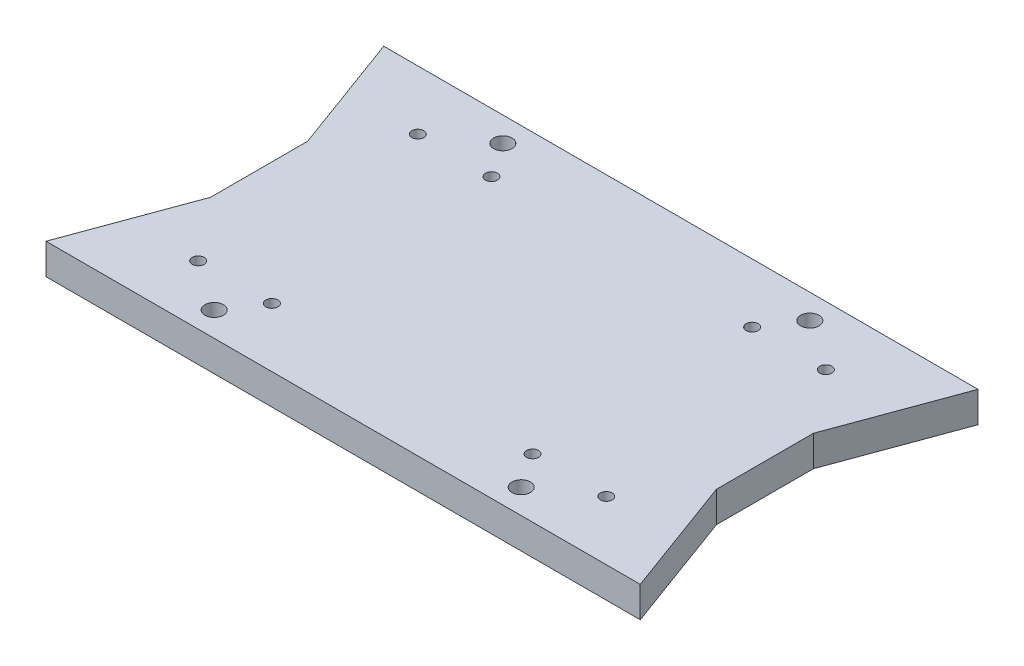
ISO-10303-21;
HEADER;
FILE_DESCRIPTION(('STEP AP214'),'2;1');
FILE_NAME('part.step','',(''),(''),'','','');
FILE_SCHEMA(('AUTOMOTIVE_DESIGN { 1 0 10303 214 1 1 1 1 }'));
ENDSEC;
DATA;
#1=APPLICATION_CONTEXT('core data for automotive mechanical design processes');
#2=APPLICATION_PROTOCOL_DEFINITION('international standard','automotive_design',2000,#1);
#3=PRODUCT_CONTEXT('',#1,'mechanical');
#4=PRODUCT('Part','Part','',(#3));
#5=PRODUCT_RELATED_PRODUCT_CATEGORY('part','',(#4));
#6=PRODUCT_DEFINITION_FORMATION('','',#4);
#7=PRODUCT_DEFINITION_CONTEXT('part definition',#1,'design');
#8=PRODUCT_DEFINITION('design','',#6,#7);
#9=PRODUCT_DEFINITION_SHAPE('','',#8);
#10=(LENGTH_UNIT() NAMED_UNIT(*) SI_UNIT(.MILLI.,.METRE.));
#11=(NAMED_UNIT(*) PLANE_ANGLE_UNIT() SI_UNIT($,.RADIAN.));
#12=(NAMED_UNIT(*) SI_UNIT($,.STERADIAN.) SOLID_ANGLE_UNIT());
#13=UNCERTAINTY_MEASURE_WITH_UNIT(LENGTH_MEASURE(1.E-05),#10,'distance_accuracy_value','');
#14=(GEOMETRIC_REPRESENTATION_CONTEXT(3) GLOBAL_UNCERTAINTY_ASSIGNED_CONTEXT((#13)) GLOBAL_UNIT_ASSIGNED_CONTEXT((#10,
#11,#12)) REPRESENTATION_CONTEXT('',''));
#15=CARTESIAN_POINT('',(0.,0.,0.));
#16=DIRECTION('',(0.,0.,1.));
#17=DIRECTION('',(1.,0.,0.));
#18=AXIS2_PLACEMENT_3D('',#15,#16,#17);
#19=CARTESIAN_POINT('',(0.,6.35,0.));
#20=DIRECTION('',(0.,1.,0.));
#21=DIRECTION('',(0.,0.,1.));
#22=AXIS2_PLACEMENT_3D('',#19,#20,#21);
#23=PLANE('',#22);
#24=CARTESIAN_POINT('',(103.635739134,6.35,-57.62800006));
#25=DIRECTION('',(0.,-1.,0.));
#26=DIRECTION('',(0.,0.,1.));
#27=AXIS2_PLACEMENT_3D('',#24,#25,#26);
#28=CIRCLE('',#27,1.2446);
#29=CARTESIAN_POINT('',(103.635739134,6.35,-56.38340006));
#30=VERTEX_POINT('',#29);
#31=EDGE_CURVE('E305',#30,#30,#28,.T.);
#32=ORIENTED_EDGE('',*,*,#31,.T.);
#33=EDGE_LOOP('',(#32));
#34=FACE_BOUND('',#33,.T.);
#35=CARTESIAN_POINT('',(88.395739134,6.35,-12.224999934));
#36=DIRECTION('',(0.,-1.,0.));
#37=DIRECTION('',(0.,0.,1.));
#38=AXIS2_PLACEMENT_3D('',#35,#36,#37);
#39=CIRCLE('',#38,1.2446);
#40=CARTESIAN_POINT('',(88.395739134,6.35,-10.980399934));
#41=VERTEX_POINT('',#40);
#42=EDGE_CURVE('E298',#41,#41,#39,.T.);
#43=ORIENTED_EDGE('',*,*,#42,.T.);
#44=EDGE_LOOP('',(#43));
#45=FACE_BOUND('',#44,.T.);
#46=CARTESIAN_POINT('',(103.635739134,6.35,-12.224999934));
#47=DIRECTION('',(0.,-1.,0.));
#48=DIRECTION('',(0.,0.,1.));
#49=AXIS2_PLACEMENT_3D('',#46,#47,#48);
#50=CIRCLE('',#49,1.2446);
#51=CARTESIAN_POINT('',(103.635739134,6.35,-10.980399934));
#52=VERTEX_POINT('',#51);
#53=EDGE_CURVE('E295',#52,#52,#50,.T.);
#54=ORIENTED_EDGE('',*,*,#53,.T.);
#55=EDGE_LOOP('',(#54));
#56=FACE_BOUND('',#55,.T.);
#57=CARTESIAN_POINT('',(88.395739134,6.35,-57.62800006));
#58=DIRECTION('',(0.,-1.,0.));
#59=DIRECTION('',(0.,0.,1.));
#60=AXIS2_PLACEMENT_3D('',#57,#58,#59);
#61=CIRCLE('',#60,1.2446);
#62=CARTESIAN_POINT('',(88.395739134,6.35,-56.38340006));
#63=VERTEX_POINT('',#62);
#64=EDGE_CURVE('E304',#63,#63,#61,.T.);
#65=ORIENTED_EDGE('',*,*,#64,.T.);
#66=EDGE_LOOP('',(#65));
#67=FACE_BOUND('',#66,.T.);
#68=CARTESIAN_POINT('',(19.250278238,6.35,-57.62800006));
#69=DIRECTION('',(0.,1.,0.));
#70=DIRECTION('',(0.,0.,1.));
#71=AXIS2_PLACEMENT_3D('',#68,#69,#70);
#72=CIRCLE('',#71,1.2446);
#73=CARTESIAN_POINT('',(19.250278238,6.35,-56.38340006));
#74=VERTEX_POINT('',#73);
#75=EDGE_CURVE('E157',#74,#74,#72,.T.);
#76=ORIENTED_EDGE('',*,*,#75,.F.);
#77=EDGE_LOOP('',(#76));
#78=FACE_BOUND('',#77,.T.);
#79=CARTESIAN_POINT('',(34.490278238,6.35,-12.224999934));
#80=DIRECTION('',(0.,1.,0.));
#81=DIRECTION('',(0.,0.,1.));
#82=AXIS2_PLACEMENT_3D('',#79,#80,#81);
#83=CIRCLE('',#82,1.2446);
#84=CARTESIAN_POINT('',(34.490278238,6.35,-10.980399934));
#85=VERTEX_POINT('',#84);
#86=EDGE_CURVE('E150',#85,#85,#83,.T.);
#87=ORIENTED_EDGE('',*,*,#86,.F.);
#88=EDGE_LOOP('',(#87));
#89=FACE_BOUND('',#88,.T.);
#90=CARTESIAN_POINT('',(19.250278238,6.35,-12.224999934));
#91=DIRECTION('',(0.,1.,0.));
#92=DIRECTION('',(0.,0.,1.));
#93=AXIS2_PLACEMENT_3D('',#90,#91,#92);
#94=CIRCLE('',#93,1.2446);
#95=CARTESIAN_POINT('',(19.250278238,6.35,-10.980399934));
#96=VERTEX_POINT('',#95);
#97=EDGE_CURVE('E119',#96,#96,#94,.T.);
#98=ORIENTED_EDGE('',*,*,#97,.F.);
#99=EDGE_LOOP('',(#98));
#100=FACE_BOUND('',#99,.T.);
#101=CARTESIAN_POINT('',(34.490278238,6.35,-57.62800006));
#102=DIRECTION('',(0.,1.,0.));
#103=DIRECTION('',(0.,0.,1.));
#104=AXIS2_PLACEMENT_3D('',#101,#102,#103);
#105=CIRCLE('',#104,1.2446);
#106=CARTESIAN_POINT('',(34.490278238,6.35,-56.38340006));
#107=VERTEX_POINT('',#106);
#108=EDGE_CURVE('E156',#107,#107,#105,.T.);
#109=ORIENTED_EDGE('',*,*,#108,.F.);
#110=EDGE_LOOP('',(#109));
#111=FACE_BOUND('',#110,.T.);
#112=CARTESIAN_POINT('',(29.693008686,6.35,-64.7700000000001));
#113=DIRECTION('',(0.,1.,0.));
#114=DIRECTION('',(0.,0.,1.));
#115=AXIS2_PLACEMENT_3D('',#112,#113,#114);
#116=CIRCLE('',#115,1.90500000000001);
#117=CARTESIAN_POINT('',(29.693008686,6.35,-62.8650000000001));
#118=VERTEX_POINT('',#117);
#119=EDGE_CURVE('E177',#118,#118,#116,.T.);
#120=ORIENTED_EDGE('',*,*,#119,.F.);
#121=EDGE_LOOP('',(#120));
#122=FACE_BOUND('',#121,.T.);
#123=DIRECTION('',(-0.344780849917447,0.,0.938683208292448));
#124=VECTOR('',#123,1.);
#125=CARTESIAN_POINT('',(9.144,6.35,-24.894999994));
#126=LINE('',#125,#124);
#127=CARTESIAN_POINT('',(9.144,6.35,-24.894999994));
#128=VERTEX_POINT('',#127);
#129=CARTESIAN_POINT('',(0.,6.35,0.));
#130=VERTEX_POINT('',#129);
#131=EDGE_CURVE('E183',#128,#130,#126,.T.);
#132=ORIENTED_EDGE('',*,*,#131,.T.);
#133=DIRECTION('',(1.,0.,0.));
#134=VECTOR('',#133,1.);
#135=CARTESIAN_POINT('',(0.,6.35,0.));
#136=LINE('',#135,#134);
#137=CARTESIAN_POINT('',(122.886017372,6.35,0.));
#138=VERTEX_POINT('',#137);
#139=EDGE_CURVE('E81',#130,#138,#136,.T.);
#140=ORIENTED_EDGE('',*,*,#139,.T.);
#141=DIRECTION('',(0.344780849917447,0.,0.938683208292448));
#142=VECTOR('',#141,1.);
#143=CARTESIAN_POINT('',(113.742017372,6.35,-24.894999994));
#144=LINE('',#143,#142);
#145=CARTESIAN_POINT('',(113.742017372,6.35,-24.894999994));
#146=VERTEX_POINT('',#145);
#147=EDGE_CURVE('E112',#146,#138,#144,.T.);
#148=ORIENTED_EDGE('',*,*,#147,.F.);
#149=DIRECTION('',(0.,0.,1.));
#150=VECTOR('',#149,1.);
#151=CARTESIAN_POINT('',(113.742017372,6.35,-44.958));
#152=LINE('',#151,#150);
#153=CARTESIAN_POINT('',(113.742017372,6.35,-44.958));
#154=VERTEX_POINT('',#153);
#155=EDGE_CURVE('E125',#154,#146,#152,.T.);
#156=ORIENTED_EDGE('',*,*,#155,.F.);
#157=DIRECTION('',(-0.344817462679615,0.,0.938669759516728));
#158=VECTOR('',#157,1.);
#159=CARTESIAN_POINT('',(122.886017372,6.35,-69.85));
#160=LINE('',#159,#158);
#161=CARTESIAN_POINT('',(122.886017372,6.35,-69.85));
#162=VERTEX_POINT('',#161);
#163=EDGE_CURVE('E130',#162,#154,#160,.T.);
#164=ORIENTED_EDGE('',*,*,#163,.F.);
#165=DIRECTION('',(-1.,0.,0.));
#166=VECTOR('',#165,1.);
#167=CARTESIAN_POINT('',(0.,6.35,-69.85));
#168=LINE('',#167,#166);
#169=CARTESIAN_POINT('',(0.,6.35,-69.85));
#170=VERTEX_POINT('',#169);
#171=EDGE_CURVE('E186',#162,#170,#168,.T.);
#172=ORIENTED_EDGE('',*,*,#171,.T.);
#173=DIRECTION('',(0.344817462679615,0.,0.938669759516728));
#174=VECTOR('',#173,1.);
#175=CARTESIAN_POINT('',(0.,6.35,-69.85));
#176=LINE('',#175,#174);
#177=CARTESIAN_POINT('',(9.144,6.35,-44.958));
#178=VERTEX_POINT('',#177);
#179=EDGE_CURVE('E188',#170,#178,#176,.T.);
#180=ORIENTED_EDGE('',*,*,#179,.T.);
#181=DIRECTION('',(0.,0.,1.));
#182=VECTOR('',#181,1.);
#183=CARTESIAN_POINT('',(9.144,6.35,-44.958));
#184=LINE('',#183,#182);
#185=EDGE_CURVE('E50',#178,#128,#184,.T.);
#186=ORIENTED_EDGE('',*,*,#185,.T.);
#187=EDGE_LOOP('',(#132,#140,#148,#156,#164,#172,#180,#186));
#188=FACE_BOUND('',#187,.T.);
#189=CARTESIAN_POINT('',(29.693008686,6.35,-5.08000000000011));
#190=DIRECTION('',(0.,1.,0.));
#191=DIRECTION('',(0.,0.,1.));
#192=AXIS2_PLACEMENT_3D('',#189,#190,#191);
#193=CIRCLE('',#192,1.90500000000001);
#194=CARTESIAN_POINT('',(29.693008686,6.35,-3.1750000000001));
#195=VERTEX_POINT('',#194);
#196=EDGE_CURVE('E171',#195,#195,#193,.T.);
#197=ORIENTED_EDGE('',*,*,#196,.F.);
#198=EDGE_LOOP('',(#197));
#199=FACE_BOUND('',#198,.T.);
#200=CARTESIAN_POINT('',(93.193008686,6.35,-5.08000000000011));
#201=DIRECTION('',(0.,-1.,0.));
#202=DIRECTION('',(0.,0.,1.));
#203=AXIS2_PLACEMENT_3D('',#200,#201,#202);
#204=CIRCLE('',#203,1.90500000000001);
#205=CARTESIAN_POINT('',(93.193008686,6.35,-3.1750000000001));
#206=VERTEX_POINT('',#205);
#207=EDGE_CURVE('E318',#206,#206,#204,.T.);
#208=ORIENTED_EDGE('',*,*,#207,.T.);
#209=EDGE_LOOP('',(#208));
#210=FACE_BOUND('',#209,.T.);
#211=CARTESIAN_POINT('',(93.193008686,6.35,-64.7700000000001));
#212=DIRECTION('',(0.,-1.,0.));
#213=DIRECTION('',(0.,0.,1.));
#214=AXIS2_PLACEMENT_3D('',#211,#212,#213);
#215=CIRCLE('',#214,1.90500000000001);
#216=CARTESIAN_POINT('',(93.193008686,6.35,-62.8650000000001));
#217=VERTEX_POINT('',#216);
#218=EDGE_CURVE('E138',#217,#217,#215,.T.);
#219=ORIENTED_EDGE('',*,*,#218,.T.);
#220=EDGE_LOOP('',(#219));
#221=FACE_BOUND('',#220,.T.);
#222=ADVANCED_FACE('F33',(#34,#45,#56,#67,#78,#89,#100,#111,#122,#188,#199,#210,#221),#23,.T.);
#223=CARTESIAN_POINT('',(0.,0.,0.));
#224=DIRECTION('',(0.,1.,0.));
#225=DIRECTION('',(0.,0.,1.));
#226=AXIS2_PLACEMENT_3D('',#223,#224,#225);
#227=PLANE('',#226);
#228=CARTESIAN_POINT('',(103.635739134,0.,-57.62800006));
#229=DIRECTION('',(0.,-1.,0.));
#230=DIRECTION('',(0.,0.,1.));
#231=AXIS2_PLACEMENT_3D('',#228,#229,#230);
#232=CIRCLE('',#231,1.2446);
#233=CARTESIAN_POINT('',(103.635739134,0.,-56.38340006));
#234=VERTEX_POINT('',#233);
#235=EDGE_CURVE('E301',#234,#234,#232,.T.);
#236=ORIENTED_EDGE('',*,*,#235,.F.);
#237=EDGE_LOOP('',(#236));
#238=FACE_BOUND('',#237,.T.);
#239=CARTESIAN_POINT('',(88.395739134,0.,-12.224999934));
#240=DIRECTION('',(0.,-1.,0.));
#241=DIRECTION('',(0.,0.,1.));
#242=AXIS2_PLACEMENT_3D('',#239,#240,#241);
#243=CIRCLE('',#242,1.2446);
#244=CARTESIAN_POINT('',(88.395739134,0.,-10.980399934));
#245=VERTEX_POINT('',#244);
#246=EDGE_CURVE('E307',#245,#245,#243,.T.);
#247=ORIENTED_EDGE('',*,*,#246,.F.);
#248=EDGE_LOOP('',(#247));
#249=FACE_BOUND('',#248,.T.);
#250=CARTESIAN_POINT('',(103.635739134,0.,-12.224999934));
#251=DIRECTION('',(0.,-1.,0.));
#252=DIRECTION('',(0.,0.,1.));
#253=AXIS2_PLACEMENT_3D('',#250,#251,#252);
#254=CIRCLE('',#253,1.2446);
#255=CARTESIAN_POINT('',(103.635739134,0.,-10.980399934));
#256=VERTEX_POINT('',#255);
#257=EDGE_CURVE('E292',#256,#256,#254,.T.);
#258=ORIENTED_EDGE('',*,*,#257,.F.);
#259=EDGE_LOOP('',(#258));
#260=FACE_BOUND('',#259,.T.);
#261=CARTESIAN_POINT('',(88.395739134,0.,-57.62800006));
#262=DIRECTION('',(0.,-1.,0.));
#263=DIRECTION('',(0.,0.,1.));
#264=AXIS2_PLACEMENT_3D('',#261,#262,#263);
#265=CIRCLE('',#264,1.2446);
#266=CARTESIAN_POINT('',(88.395739134,0.,-56.38340006));
#267=VERTEX_POINT('',#266);
#268=EDGE_CURVE('E312',#267,#267,#265,.T.);
#269=ORIENTED_EDGE('',*,*,#268,.F.);
#270=EDGE_LOOP('',(#269));
#271=FACE_BOUND('',#270,.T.);
#272=CARTESIAN_POINT('',(19.250278238,0.,-57.62800006));
#273=DIRECTION('',(0.,1.,0.));
#274=DIRECTION('',(0.,0.,1.));
#275=AXIS2_PLACEMENT_3D('',#272,#273,#274);
#276=CIRCLE('',#275,1.2446);
#277=CARTESIAN_POINT('',(19.250278238,0.,-56.38340006));
#278=VERTEX_POINT('',#277);
#279=EDGE_CURVE('E153',#278,#278,#276,.T.);
#280=ORIENTED_EDGE('',*,*,#279,.T.);
#281=EDGE_LOOP('',(#280));
#282=FACE_BOUND('',#281,.T.);
#283=CARTESIAN_POINT('',(34.490278238,0.,-12.224999934));
#284=DIRECTION('',(0.,1.,0.));
#285=DIRECTION('',(0.,0.,1.));
#286=AXIS2_PLACEMENT_3D('',#283,#284,#285);
#287=CIRCLE('',#286,1.2446);
#288=CARTESIAN_POINT('',(34.490278238,0.,-10.980399934));
#289=VERTEX_POINT('',#288);
#290=EDGE_CURVE('E160',#289,#289,#287,.T.);
#291=ORIENTED_EDGE('',*,*,#290,.T.);
#292=EDGE_LOOP('',(#291));
#293=FACE_BOUND('',#292,.T.);
#294=CARTESIAN_POINT('',(19.250278238,0.,-12.224999934));
#295=DIRECTION('',(0.,1.,0.));
#296=DIRECTION('',(0.,0.,1.));
#297=AXIS2_PLACEMENT_3D('',#294,#295,#296);
#298=CIRCLE('',#297,1.2446);
#299=CARTESIAN_POINT('',(19.250278238,0.,-10.980399934));
#300=VERTEX_POINT('',#299);
#301=EDGE_CURVE('E147',#300,#300,#298,.T.);
#302=ORIENTED_EDGE('',*,*,#301,.T.);
#303=EDGE_LOOP('',(#302));
#304=FACE_BOUND('',#303,.T.);
#305=CARTESIAN_POINT('',(34.490278238,0.,-57.62800006));
#306=DIRECTION('',(0.,1.,0.));
#307=DIRECTION('',(0.,0.,1.));
#308=AXIS2_PLACEMENT_3D('',#305,#306,#307);
#309=CIRCLE('',#308,1.2446);
#310=CARTESIAN_POINT('',(34.490278238,0.,-56.38340006));
#311=VERTEX_POINT('',#310);
#312=EDGE_CURVE('E165',#311,#311,#309,.T.);
#313=ORIENTED_EDGE('',*,*,#312,.T.);
#314=EDGE_LOOP('',(#313));
#315=FACE_BOUND('',#314,.T.);
#316=DIRECTION('',(-0.344780849917447,0.,0.938683208292448));
#317=VECTOR('',#316,1.);
#318=CARTESIAN_POINT('',(9.144,0.,-24.894999994));
#319=LINE('',#318,#317);
#320=CARTESIAN_POINT('',(9.144,0.,-24.894999994));
#321=VERTEX_POINT('',#320);
#322=CARTESIAN_POINT('',(0.,0.,0.));
#323=VERTEX_POINT('',#322);
#324=EDGE_CURVE('E180',#321,#323,#319,.T.);
#325=ORIENTED_EDGE('',*,*,#324,.F.);
#326=DIRECTION('',(0.,0.,1.));
#327=VECTOR('',#326,1.);
#328=CARTESIAN_POINT('',(9.144,0.,-44.958));
#329=LINE('',#328,#327);
#330=CARTESIAN_POINT('',(9.144,0.,-44.958));
#331=VERTEX_POINT('',#330);
#332=EDGE_CURVE('E74',#331,#321,#329,.T.);
#333=ORIENTED_EDGE('',*,*,#332,.F.);
#334=DIRECTION('',(0.344817462679615,0.,0.938669759516728));
#335=VECTOR('',#334,1.);
#336=CARTESIAN_POINT('',(0.,0.,-69.85));
#337=LINE('',#336,#335);
#338=CARTESIAN_POINT('',(0.,0.,-69.85));
#339=VERTEX_POINT('',#338);
#340=EDGE_CURVE('E68',#339,#331,#337,.T.);
#341=ORIENTED_EDGE('',*,*,#340,.F.);
#342=DIRECTION('',(-1.,0.,0.));
#343=VECTOR('',#342,1.);
#344=CARTESIAN_POINT('',(0.,0.,-69.85));
#345=LINE('',#344,#343);
#346=CARTESIAN_POINT('',(122.886017372,0.,-69.85));
#347=VERTEX_POINT('',#346);
#348=EDGE_CURVE('E196',#347,#339,#345,.T.);
#349=ORIENTED_EDGE('',*,*,#348,.F.);
#350=DIRECTION('',(-0.344817462679615,0.,0.938669759516728));
#351=VECTOR('',#350,1.);
#352=CARTESIAN_POINT('',(122.886017372,0.,-69.85));
#353=LINE('',#352,#351);
#354=CARTESIAN_POINT('',(113.742017372,0.,-44.958));
#355=VERTEX_POINT('',#354);
#356=EDGE_CURVE('E127',#347,#355,#353,.T.);
#357=ORIENTED_EDGE('',*,*,#356,.T.);
#358=DIRECTION('',(0.,0.,1.));
#359=VECTOR('',#358,1.);
#360=CARTESIAN_POINT('',(113.742017372,0.,-44.958));
#361=LINE('',#360,#359);
#362=CARTESIAN_POINT('',(113.742017372,0.,-24.894999994));
#363=VERTEX_POINT('',#362);
#364=EDGE_CURVE('E137',#355,#363,#361,.T.);
#365=ORIENTED_EDGE('',*,*,#364,.T.);
#366=DIRECTION('',(0.344780849917447,0.,0.938683208292448));
#367=VECTOR('',#366,1.);
#368=CARTESIAN_POINT('',(113.742017372,0.,-24.894999994));
#369=LINE('',#368,#367);
#370=CARTESIAN_POINT('',(122.886017372,0.,0.));
#371=VERTEX_POINT('',#370);
#372=EDGE_CURVE('E114',#363,#371,#369,.T.);
#373=ORIENTED_EDGE('',*,*,#372,.T.);
#374=DIRECTION('',(1.,0.,0.));
#375=VECTOR('',#374,1.);
#376=CARTESIAN_POINT('',(0.,0.,0.));
#377=LINE('',#376,#375);
#378=EDGE_CURVE('E194',#323,#371,#377,.T.);
#379=ORIENTED_EDGE('',*,*,#378,.F.);
#380=EDGE_LOOP('',(#325,#333,#341,#349,#357,#365,#373,#379));
#381=FACE_BOUND('',#380,.T.);
#382=CARTESIAN_POINT('',(29.693008686,0.,-64.7700000000001));
#383=DIRECTION('',(0.,1.,0.));
#384=DIRECTION('',(0.,0.,1.));
#385=AXIS2_PLACEMENT_3D('',#382,#383,#384);
#386=CIRCLE('',#385,1.90500000000001);
#387=CARTESIAN_POINT('',(29.693008686,0.,-62.8650000000001));
#388=VERTEX_POINT('',#387);
#389=EDGE_CURVE('E174',#388,#388,#386,.T.);
#390=ORIENTED_EDGE('',*,*,#389,.T.);
#391=EDGE_LOOP('',(#390));
#392=FACE_BOUND('',#391,.T.);
#393=CARTESIAN_POINT('',(29.693008686,0.,-5.08000000000011));
#394=DIRECTION('',(0.,1.,0.));
#395=DIRECTION('',(0.,0.,1.));
#396=AXIS2_PLACEMENT_3D('',#393,#394,#395);
#397=CIRCLE('',#396,1.90500000000001);
#398=CARTESIAN_POINT('',(29.693008686,0.,-3.1750000000001));
#399=VERTEX_POINT('',#398);
#400=EDGE_CURVE('E168',#399,#399,#397,.T.);
#401=ORIENTED_EDGE('',*,*,#400,.T.);
#402=EDGE_LOOP('',(#401));
#403=FACE_BOUND('',#402,.T.);
#404=CARTESIAN_POINT('',(93.193008686,0.,-5.08000000000011));
#405=DIRECTION('',(0.,-1.,0.));
#406=DIRECTION('',(0.,0.,1.));
#407=AXIS2_PLACEMENT_3D('',#404,#405,#406);
#408=CIRCLE('',#407,1.90500000000001);
#409=CARTESIAN_POINT('',(93.193008686,0.,-3.1750000000001));
#410=VERTEX_POINT('',#409);
#411=EDGE_CURVE('E315',#410,#410,#408,.T.);
#412=ORIENTED_EDGE('',*,*,#411,.F.);
#413=EDGE_LOOP('',(#412));
#414=FACE_BOUND('',#413,.T.);
#415=CARTESIAN_POINT('',(93.193008686,0.,-64.7700000000001));
#416=DIRECTION('',(0.,-1.,0.));
#417=DIRECTION('',(0.,0.,1.));
#418=AXIS2_PLACEMENT_3D('',#415,#416,#417);
#419=CIRCLE('',#418,1.90500000000001);
#420=CARTESIAN_POINT('',(93.193008686,0.,-62.8650000000001));
#421=VERTEX_POINT('',#420);
#422=EDGE_CURVE('E321',#421,#421,#419,.T.);
#423=ORIENTED_EDGE('',*,*,#422,.F.);
#424=EDGE_LOOP('',(#423));
#425=FACE_BOUND('',#424,.T.);
#426=ADVANCED_FACE('F208',(#238,#249,#260,#271,#282,#293,#304,#315,#381,#392,#403,#414,#425),
#227,.F.);
#427=CARTESIAN_POINT('',(9.144,6.35,-24.894999994));
#428=DIRECTION('',(0.938683208292448,0.,0.344780849917447));
#429=DIRECTION('',(0.344780849917447,0.,-0.938683208292448));
#430=AXIS2_PLACEMENT_3D('',#427,#428,#429);
#431=PLANE('',#430);
#432=ORIENTED_EDGE('',*,*,#324,.T.);
#433=DIRECTION('',(0.,-1.,0.));
#434=VECTOR('',#433,1.);
#435=CARTESIAN_POINT('',(0.,6.35,0.));
#436=LINE('',#435,#434);
#437=EDGE_CURVE('E11',#130,#323,#436,.T.);
#438=ORIENTED_EDGE('',*,*,#437,.F.);
#439=ORIENTED_EDGE('',*,*,#131,.F.);
#440=DIRECTION('',(0.,-1.,0.));
#441=VECTOR('',#440,1.);
#442=CARTESIAN_POINT('',(9.144,6.35,-24.894999994));
#443=LINE('',#442,#441);
#444=EDGE_CURVE('E191',#128,#321,#443,.T.);
#445=ORIENTED_EDGE('',*,*,#444,.T.);
#446=EDGE_LOOP('',(#432,#438,#439,#445));
#447=FACE_BOUND('',#446,.T.);
#448=ADVANCED_FACE('F35',(#447),#431,.F.);
#449=CARTESIAN_POINT('',(0.,6.35,0.));
#450=DIRECTION('',(0.,0.,-1.));
#451=DIRECTION('',(-1.,0.,0.));
#452=AXIS2_PLACEMENT_3D('',#449,#450,#451);
#453=PLANE('',#452);
#454=ORIENTED_EDGE('',*,*,#378,.T.);
#455=DIRECTION('',(0.,-1.,0.));
#456=VECTOR('',#455,1.);
#457=CARTESIAN_POINT('',(122.886017372,6.35,0.));
#458=LINE('',#457,#456);
#459=EDGE_CURVE('E132',#138,#371,#458,.T.);
#460=ORIENTED_EDGE('',*,*,#459,.F.);
#461=ORIENTED_EDGE('',*,*,#139,.F.);
#462=ORIENTED_EDGE('',*,*,#437,.T.);
#463=EDGE_LOOP('',(#454,#460,#461,#462));
#464=FACE_BOUND('',#463,.T.);
#465=ADVANCED_FACE('F430',(#464),#453,.F.);
#466=CARTESIAN_POINT('',(0.,6.35,-69.85));
#467=DIRECTION('',(0.,0.,1.));
#468=DIRECTION('',(1.,0.,0.));
#469=AXIS2_PLACEMENT_3D('',#466,#467,#468);
#470=PLANE('',#469);
#471=ORIENTED_EDGE('',*,*,#348,.T.);
#472=DIRECTION('',(0.,-1.,0.));
#473=VECTOR('',#472,1.);
#474=CARTESIAN_POINT('',(0.,6.35,-69.85));
#475=LINE('',#474,#473);
#476=EDGE_CURVE('E42',#170,#339,#475,.T.);
#477=ORIENTED_EDGE('',*,*,#476,.F.);
#478=ORIENTED_EDGE('',*,*,#171,.F.);
#479=DIRECTION('',(0.,-1.,0.));
#480=VECTOR('',#479,1.);
#481=CARTESIAN_POINT('',(122.886017372,6.35,-69.85));
#482=LINE('',#481,#480);
#483=EDGE_CURVE('E143',#162,#347,#482,.T.);
#484=ORIENTED_EDGE('',*,*,#483,.T.);
#485=EDGE_LOOP('',(#471,#477,#478,#484));
#486=FACE_BOUND('',#485,.T.);
#487=ADVANCED_FACE('F224',(#486),#470,.F.);
#488=CARTESIAN_POINT('',(0.,6.35,-69.85));
#489=DIRECTION('',(0.938669759516728,0.,-0.344817462679614));
#490=DIRECTION('',(-0.344817462679615,0.,-0.938669759516728));
#491=AXIS2_PLACEMENT_3D('',#488,#489,#490);
#492=PLANE('',#491);
#493=ORIENTED_EDGE('',*,*,#340,.T.);
#494=DIRECTION('',(0.,-1.,0.));
#495=VECTOR('',#494,1.);
#496=CARTESIAN_POINT('',(9.144,6.35,-44.958));
#497=LINE('',#496,#495);
#498=EDGE_CURVE('E201',#178,#331,#497,.T.);
#499=ORIENTED_EDGE('',*,*,#498,.F.);
#500=ORIENTED_EDGE('',*,*,#179,.F.);
#501=ORIENTED_EDGE('',*,*,#476,.T.);
#502=EDGE_LOOP('',(#493,#499,#500,#501));
#503=FACE_BOUND('',#502,.T.);
#504=ADVANCED_FACE('F204',(#503),#492,.F.);
#505=CARTESIAN_POINT('',(9.144,6.35,-44.958));
#506=DIRECTION('',(1.,0.,0.));
#507=DIRECTION('',(0.,0.,-1.));
#508=AXIS2_PLACEMENT_3D('',#505,#506,#507);
#509=PLANE('',#508);
#510=ORIENTED_EDGE('',*,*,#332,.T.);
#511=ORIENTED_EDGE('',*,*,#444,.F.);
#512=ORIENTED_EDGE('',*,*,#185,.F.);
#513=ORIENTED_EDGE('',*,*,#498,.T.);
#514=EDGE_LOOP('',(#510,#511,#512,#513));
#515=FACE_BOUND('',#514,.T.);
#516=ADVANCED_FACE('F213',(#515),#509,.F.);
#517=CARTESIAN_POINT('',(29.693008686,6.35,-64.7700000000001));
#518=DIRECTION('',(0.,-1.,0.));
#519=DIRECTION('',(0.,0.,-1.));
#520=AXIS2_PLACEMENT_3D('',#517,#518,#519);
#521=CYLINDRICAL_SURFACE('',#520,1.90500000000001);
#522=ORIENTED_EDGE('',*,*,#119,.T.);
#523=EDGE_LOOP('',(#522));
#524=FACE_BOUND('',#523,.T.);
#525=ORIENTED_EDGE('',*,*,#389,.F.);
#526=EDGE_LOOP('',(#525));
#527=FACE_BOUND('',#526,.T.);
#528=ADVANCED_FACE('F215',(#524,#527),#521,.F.);
#529=CARTESIAN_POINT('',(29.693008686,6.35,-5.08000000000011));
#530=DIRECTION('',(0.,-1.,0.));
#531=DIRECTION('',(0.,0.,-1.));
#532=AXIS2_PLACEMENT_3D('',#529,#530,#531);
#533=CYLINDRICAL_SURFACE('',#532,1.90500000000001);
#534=ORIENTED_EDGE('',*,*,#196,.T.);
#535=EDGE_LOOP('',(#534));
#536=FACE_BOUND('',#535,.T.);
#537=ORIENTED_EDGE('',*,*,#400,.F.);
#538=EDGE_LOOP('',(#537));
#539=FACE_BOUND('',#538,.T.);
#540=ADVANCED_FACE('F221',(#536,#539),#533,.F.);
#541=CARTESIAN_POINT('',(34.490278238,0.,-57.62800006));
#542=DIRECTION('',(0.,1.,0.));
#543=DIRECTION('',(0.,0.,1.));
#544=AXIS2_PLACEMENT_3D('',#541,#542,#543);
#545=CYLINDRICAL_SURFACE('',#544,1.2446);
#546=ORIENTED_EDGE('',*,*,#312,.F.);
#547=EDGE_LOOP('',(#546));
#548=FACE_BOUND('',#547,.T.);
#549=ORIENTED_EDGE('',*,*,#108,.T.);
#550=EDGE_LOOP('',(#549));
#551=FACE_BOUND('',#550,.T.);
#552=ADVANCED_FACE('F239',(#548,#551),#545,.F.);
#553=CARTESIAN_POINT('',(19.250278238,0.,-12.224999934));
#554=DIRECTION('',(0.,1.,0.));
#555=DIRECTION('',(0.,0.,1.));
#556=AXIS2_PLACEMENT_3D('',#553,#554,#555);
#557=CYLINDRICAL_SURFACE('',#556,1.2446);
#558=ORIENTED_EDGE('',*,*,#301,.F.);
#559=EDGE_LOOP('',(#558));
#560=FACE_BOUND('',#559,.T.);
#561=ORIENTED_EDGE('',*,*,#97,.T.);
#562=EDGE_LOOP('',(#561));
#563=FACE_BOUND('',#562,.T.);
#564=ADVANCED_FACE('F243',(#560,#563),#557,.F.);
#565=CARTESIAN_POINT('',(34.490278238,0.,-12.224999934));
#566=DIRECTION('',(0.,1.,0.));
#567=DIRECTION('',(0.,0.,1.));
#568=AXIS2_PLACEMENT_3D('',#565,#566,#567);
#569=CYLINDRICAL_SURFACE('',#568,1.2446);
#570=ORIENTED_EDGE('',*,*,#290,.F.);
#571=EDGE_LOOP('',(#570));
#572=FACE_BOUND('',#571,.T.);
#573=ORIENTED_EDGE('',*,*,#86,.T.);
#574=EDGE_LOOP('',(#573));
#575=FACE_BOUND('',#574,.T.);
#576=ADVANCED_FACE('F245',(#572,#575),#569,.F.);
#577=CARTESIAN_POINT('',(19.250278238,0.,-57.62800006));
#578=DIRECTION('',(0.,1.,0.));
#579=DIRECTION('',(0.,0.,1.));
#580=AXIS2_PLACEMENT_3D('',#577,#578,#579);
#581=CYLINDRICAL_SURFACE('',#580,1.2446);
#582=ORIENTED_EDGE('',*,*,#279,.F.);
#583=EDGE_LOOP('',(#582));
#584=FACE_BOUND('',#583,.T.);
#585=ORIENTED_EDGE('',*,*,#75,.T.);
#586=EDGE_LOOP('',(#585));
#587=FACE_BOUND('',#586,.T.);
#588=ADVANCED_FACE('F248',(#584,#587),#581,.F.);
#589=CARTESIAN_POINT('',(113.742017372,6.35,-24.894999994));
#590=DIRECTION('',(0.938683208292448,0.,-0.344780849917446));
#591=DIRECTION('',(-0.344780849917446,0.,-0.938683208292448));
#592=AXIS2_PLACEMENT_3D('',#589,#590,#591);
#593=PLANE('',#592);
#594=ORIENTED_EDGE('',*,*,#372,.F.);
#595=DIRECTION('',(0.,-1.,0.));
#596=VECTOR('',#595,1.);
#597=CARTESIAN_POINT('',(113.742017372,6.35,-24.894999994));
#598=LINE('',#597,#596);
#599=EDGE_CURVE('E108',#146,#363,#598,.T.);
#600=ORIENTED_EDGE('',*,*,#599,.F.);
#601=ORIENTED_EDGE('',*,*,#147,.T.);
#602=ORIENTED_EDGE('',*,*,#459,.T.);
#603=EDGE_LOOP('',(#594,#600,#601,#602));
#604=FACE_BOUND('',#603,.T.);
#605=ADVANCED_FACE('F110',(#604),#593,.T.);
#606=CARTESIAN_POINT('',(113.742017372,6.35,-44.958));
#607=DIRECTION('',(1.,0.,0.));
#608=DIRECTION('',(0.,0.,-1.));
#609=AXIS2_PLACEMENT_3D('',#606,#607,#608);
#610=PLANE('',#609);
#611=ORIENTED_EDGE('',*,*,#364,.F.);
#612=DIRECTION('',(0.,-1.,0.));
#613=VECTOR('',#612,1.);
#614=CARTESIAN_POINT('',(113.742017372,6.35,-44.958));
#615=LINE('',#614,#613);
#616=EDGE_CURVE('E120',#154,#355,#615,.T.);
#617=ORIENTED_EDGE('',*,*,#616,.F.);
#618=ORIENTED_EDGE('',*,*,#155,.T.);
#619=ORIENTED_EDGE('',*,*,#599,.T.);
#620=EDGE_LOOP('',(#611,#617,#618,#619));
#621=FACE_BOUND('',#620,.T.);
#622=ADVANCED_FACE('F129',(#621),#610,.T.);
#623=CARTESIAN_POINT('',(122.886017372,6.35,-69.85));
#624=DIRECTION('',(0.938669759516728,0.,0.344817462679615));
#625=DIRECTION('',(0.344817462679615,0.,-0.938669759516728));
#626=AXIS2_PLACEMENT_3D('',#623,#624,#625);
#627=PLANE('',#626);
#628=ORIENTED_EDGE('',*,*,#356,.F.);
#629=ORIENTED_EDGE('',*,*,#483,.F.);
#630=ORIENTED_EDGE('',*,*,#163,.T.);
#631=ORIENTED_EDGE('',*,*,#616,.T.);
#632=EDGE_LOOP('',(#628,#629,#630,#631));
#633=FACE_BOUND('',#632,.T.);
#634=ADVANCED_FACE('F260',(#633),#627,.T.);
#635=CARTESIAN_POINT('',(93.193008686,6.35,-64.7700000000001));
#636=DIRECTION('',(0.,-1.,0.));
#637=DIRECTION('',(0.,0.,-1.));
#638=AXIS2_PLACEMENT_3D('',#635,#636,#637);
#639=CYLINDRICAL_SURFACE('',#638,1.90500000000001);
#640=ORIENTED_EDGE('',*,*,#218,.F.);
#641=EDGE_LOOP('',(#640));
#642=FACE_BOUND('',#641,.T.);
#643=ORIENTED_EDGE('',*,*,#422,.T.);
#644=EDGE_LOOP('',(#643));
#645=FACE_BOUND('',#644,.T.);
#646=ADVANCED_FACE('F263',(#642,#645),#639,.F.);
#647=CARTESIAN_POINT('',(93.193008686,6.35,-5.08000000000011));
#648=DIRECTION('',(0.,-1.,0.));
#649=DIRECTION('',(0.,0.,-1.));
#650=AXIS2_PLACEMENT_3D('',#647,#648,#649);
#651=CYLINDRICAL_SURFACE('',#650,1.90500000000001);
#652=ORIENTED_EDGE('',*,*,#207,.F.);
#653=EDGE_LOOP('',(#652));
#654=FACE_BOUND('',#653,.T.);
#655=ORIENTED_EDGE('',*,*,#411,.T.);
#656=EDGE_LOOP('',(#655));
#657=FACE_BOUND('',#656,.T.);
#658=ADVANCED_FACE('F267',(#654,#657),#651,.F.);
#659=CARTESIAN_POINT('',(88.395739134,0.,-57.62800006));
#660=DIRECTION('',(0.,1.,0.));
#661=DIRECTION('',(0.,0.,1.));
#662=AXIS2_PLACEMENT_3D('',#659,#660,#661);
#663=CYLINDRICAL_SURFACE('',#662,1.2446);
#664=ORIENTED_EDGE('',*,*,#268,.T.);
#665=EDGE_LOOP('',(#664));
#666=FACE_BOUND('',#665,.T.);
#667=ORIENTED_EDGE('',*,*,#64,.F.);
#668=EDGE_LOOP('',(#667));
#669=FACE_BOUND('',#668,.T.);
#670=ADVANCED_FACE('F271',(#666,#669),#663,.F.);
#671=CARTESIAN_POINT('',(103.635739134,0.,-12.224999934));
#672=DIRECTION('',(0.,1.,0.));
#673=DIRECTION('',(0.,0.,1.));
#674=AXIS2_PLACEMENT_3D('',#671,#672,#673);
#675=CYLINDRICAL_SURFACE('',#674,1.2446);
#676=ORIENTED_EDGE('',*,*,#257,.T.);
#677=EDGE_LOOP('',(#676));
#678=FACE_BOUND('',#677,.T.);
#679=ORIENTED_EDGE('',*,*,#53,.F.);
#680=EDGE_LOOP('',(#679));
#681=FACE_BOUND('',#680,.T.);
#682=ADVANCED_FACE('F275',(#678,#681),#675,.F.);
#683=CARTESIAN_POINT('',(88.395739134,0.,-12.224999934));
#684=DIRECTION('',(0.,1.,0.));
#685=DIRECTION('',(0.,0.,1.));
#686=AXIS2_PLACEMENT_3D('',#683,#684,#685);
#687=CYLINDRICAL_SURFACE('',#686,1.2446);
#688=ORIENTED_EDGE('',*,*,#246,.T.);
#689=EDGE_LOOP('',(#688));
#690=FACE_BOUND('',#689,.T.);
#691=ORIENTED_EDGE('',*,*,#42,.F.);
#692=EDGE_LOOP('',(#691));
#693=FACE_BOUND('',#692,.T.);
#694=ADVANCED_FACE('F277',(#690,#693),#687,.F.);
#695=CARTESIAN_POINT('',(103.635739134,0.,-57.62800006));
#696=DIRECTION('',(0.,1.,0.));
#697=DIRECTION('',(0.,0.,1.));
#698=AXIS2_PLACEMENT_3D('',#695,#696,#697);
#699=CYLINDRICAL_SURFACE('',#698,1.2446);
#700=ORIENTED_EDGE('',*,*,#235,.T.);
#701=EDGE_LOOP('',(#700));
#702=FACE_BOUND('',#701,.T.);
#703=ORIENTED_EDGE('',*,*,#31,.F.);
#704=EDGE_LOOP('',(#703));
#705=FACE_BOUND('',#704,.T.);
#706=ADVANCED_FACE('F280',(#702,#705),#699,.F.);
#707=CLOSED_SHELL('',(#222,#426,#448,#465,#487,#504,#516,#528,#540,#552,#564,#576,#588,#605,
#622,#634,#646,#658,#670,#682,#694,#706));
#708=MANIFOLD_SOLID_BREP('B2',#707);
#709=ADVANCED_BREP_SHAPE_REPRESENTATION('',(#18,#708),#14);
#710=SHAPE_DEFINITION_REPRESENTATION(#9,#709);
ENDSEC;
END-ISO-10303-21;
